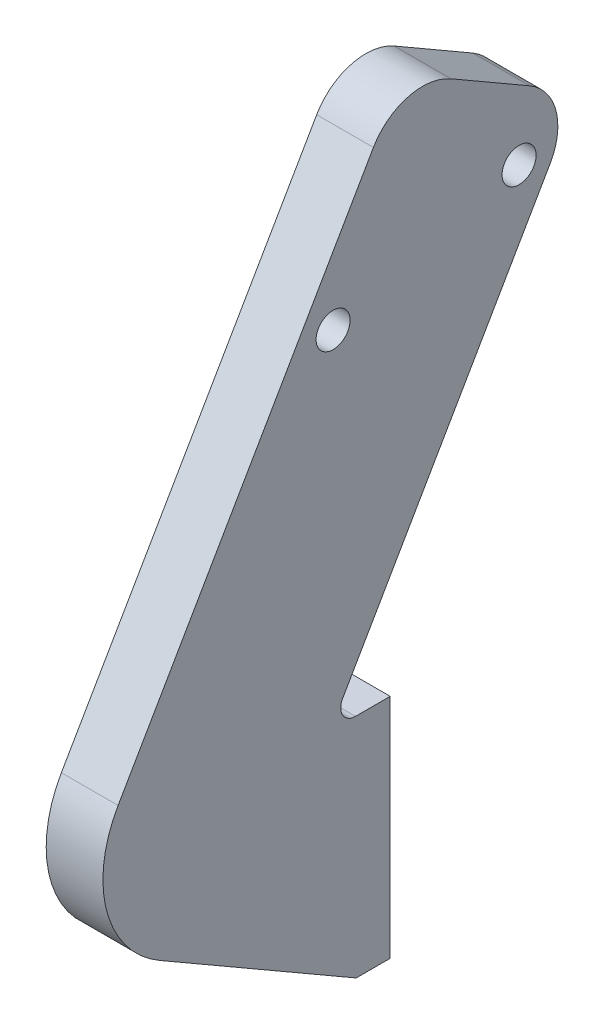
ISO-10303-21;
HEADER;
FILE_DESCRIPTION(('STEP AP214'),'2;1');
FILE_NAME('part.step','',(''),(''),'','','');
FILE_SCHEMA(('AUTOMOTIVE_DESIGN { 1 0 10303 214 1 1 1 1 }'));
ENDSEC;
DATA;
#1=APPLICATION_CONTEXT('core data for automotive mechanical design processes');
#2=APPLICATION_PROTOCOL_DEFINITION('international standard','automotive_design',2000,#1);
#3=PRODUCT_CONTEXT('',#1,'mechanical');
#4=PRODUCT('Part','Part','',(#3));
#5=PRODUCT_RELATED_PRODUCT_CATEGORY('part','',(#4));
#6=PRODUCT_DEFINITION_FORMATION('','',#4);
#7=PRODUCT_DEFINITION_CONTEXT('part definition',#1,'design');
#8=PRODUCT_DEFINITION('design','',#6,#7);
#9=PRODUCT_DEFINITION_SHAPE('','',#8);
#10=(LENGTH_UNIT() NAMED_UNIT(*) SI_UNIT(.MILLI.,.METRE.));
#11=(NAMED_UNIT(*) PLANE_ANGLE_UNIT() SI_UNIT($,.RADIAN.));
#12=(NAMED_UNIT(*) SI_UNIT($,.STERADIAN.) SOLID_ANGLE_UNIT());
#13=UNCERTAINTY_MEASURE_WITH_UNIT(LENGTH_MEASURE(1.E-05),#10,'distance_accuracy_value','');
#14=(GEOMETRIC_REPRESENTATION_CONTEXT(3) GLOBAL_UNCERTAINTY_ASSIGNED_CONTEXT((#13)) GLOBAL_UNIT_ASSIGNED_CONTEXT((#10,
#11,#12)) REPRESENTATION_CONTEXT('',''));
#15=CARTESIAN_POINT('',(0.,0.,0.));
#16=DIRECTION('',(0.,0.,1.));
#17=DIRECTION('',(1.,0.,0.));
#18=AXIS2_PLACEMENT_3D('',#15,#16,#17);
#19=CARTESIAN_POINT('',(0.,0.,3.));
#20=DIRECTION('',(0.,0.,-1.));
#21=DIRECTION('',(-1.,0.,0.));
#22=AXIS2_PLACEMENT_3D('',#19,#20,#21);
#23=PLANE('',#22);
#24=DIRECTION('',(1.,0.,0.));
#25=VECTOR('',#24,1.);
#26=CARTESIAN_POINT('',(0.,0.,3.));
#27=LINE('',#26,#25);
#28=CARTESIAN_POINT('',(0.,0.,3.));
#29=VERTEX_POINT('',#28);
#30=CARTESIAN_POINT('',(6.,0.,3.));
#31=VERTEX_POINT('',#30);
#32=EDGE_CURVE('E196',#29,#31,#27,.T.);
#33=ORIENTED_EDGE('',*,*,#32,.T.);
#34=DIRECTION('',(0.,-1.,0.));
#35=VECTOR('',#34,1.);
#36=CARTESIAN_POINT('',(6.,20.,3.));
#37=LINE('',#36,#35);
#38=CARTESIAN_POINT('',(6.,20.,3.));
#39=VERTEX_POINT('',#38);
#40=EDGE_CURVE('E170',#39,#31,#37,.T.);
#41=ORIENTED_EDGE('',*,*,#40,.F.);
#42=DIRECTION('',(-1.,0.,0.));
#43=VECTOR('',#42,1.);
#44=CARTESIAN_POINT('',(0.,20.,3.));
#45=LINE('',#44,#43);
#46=CARTESIAN_POINT('',(0.,20.,3.));
#47=VERTEX_POINT('',#46);
#48=EDGE_CURVE('E199',#39,#47,#45,.T.);
#49=ORIENTED_EDGE('',*,*,#48,.T.);
#50=DIRECTION('',(0.,-1.,0.));
#51=VECTOR('',#50,1.);
#52=CARTESIAN_POINT('',(0.,0.,3.));
#53=LINE('',#52,#51);
#54=EDGE_CURVE('E193',#47,#29,#53,.T.);
#55=ORIENTED_EDGE('',*,*,#54,.T.);
#56=EDGE_LOOP('',(#33,#41,#49,#55));
#57=FACE_BOUND('',#56,.T.);
#58=CARTESIAN_POINT('',(3.,16.25,3.));
#59=DIRECTION('',(0.,0.,1.));
#60=DIRECTION('',(1.,0.,0.));
#61=AXIS2_PLACEMENT_3D('',#58,#59,#60);
#62=CIRCLE('',#61,1.5);
#63=CARTESIAN_POINT('',(4.5,16.25,3.));
#64=VERTEX_POINT('',#63);
#65=EDGE_CURVE('E187',#64,#64,#62,.T.);
#66=ORIENTED_EDGE('',*,*,#65,.F.);
#67=EDGE_LOOP('',(#66));
#68=FACE_BOUND('',#67,.T.);
#69=CARTESIAN_POINT('',(3.00000000000013,3.75,3.));
#70=DIRECTION('',(0.,0.,1.));
#71=DIRECTION('',(1.,0.,0.));
#72=AXIS2_PLACEMENT_3D('',#69,#70,#71);
#73=CIRCLE('',#72,1.5);
#74=CARTESIAN_POINT('',(4.50000000000013,3.75,3.));
#75=VERTEX_POINT('',#74);
#76=EDGE_CURVE('E181',#75,#75,#73,.T.);
#77=ORIENTED_EDGE('',*,*,#76,.F.);
#78=EDGE_LOOP('',(#77));
#79=FACE_BOUND('',#78,.T.);
#80=ADVANCED_FACE('F37',(#57,#68,#79),#23,.F.);
#81=CARTESIAN_POINT('',(0.,0.,0.));
#82=DIRECTION('',(0.,0.,-1.));
#83=DIRECTION('',(-1.,0.,0.));
#84=AXIS2_PLACEMENT_3D('',#81,#82,#83);
#85=PLANE('',#84);
#86=DIRECTION('',(0.,1.,0.));
#87=VECTOR('',#86,1.);
#88=CARTESIAN_POINT('',(11.,0.,0.));
#89=LINE('',#88,#87);
#90=CARTESIAN_POINT('',(11.,0.,0.));
#91=VERTEX_POINT('',#90);
#92=CARTESIAN_POINT('',(11.,20.,0.));
#93=VERTEX_POINT('',#92);
#94=EDGE_CURVE('E137',#91,#93,#89,.T.);
#95=ORIENTED_EDGE('',*,*,#94,.F.);
#96=DIRECTION('',(1.,0.,0.));
#97=VECTOR('',#96,1.);
#98=CARTESIAN_POINT('',(0.,0.,0.));
#99=LINE('',#98,#97);
#100=CARTESIAN_POINT('',(0.,0.,0.));
#101=VERTEX_POINT('',#100);
#102=EDGE_CURVE('E132',#101,#91,#99,.T.);
#103=ORIENTED_EDGE('',*,*,#102,.F.);
#104=DIRECTION('',(0.,-1.,0.));
#105=VECTOR('',#104,1.);
#106=CARTESIAN_POINT('',(0.,0.,0.));
#107=LINE('',#106,#105);
#108=CARTESIAN_POINT('',(0.,20.,0.));
#109=VERTEX_POINT('',#108);
#110=EDGE_CURVE('E190',#109,#101,#107,.T.);
#111=ORIENTED_EDGE('',*,*,#110,.F.);
#112=DIRECTION('',(-1.,0.,0.));
#113=VECTOR('',#112,1.);
#114=CARTESIAN_POINT('',(0.,20.,0.));
#115=LINE('',#114,#113);
#116=EDGE_CURVE('E197',#93,#109,#115,.T.);
#117=ORIENTED_EDGE('',*,*,#116,.F.);
#118=EDGE_LOOP('',(#95,#103,#111,#117));
#119=FACE_BOUND('',#118,.T.);
#120=CARTESIAN_POINT('',(3.,16.25,0.));
#121=DIRECTION('',(0.,0.,1.));
#122=DIRECTION('',(1.,0.,0.));
#123=AXIS2_PLACEMENT_3D('',#120,#121,#122);
#124=CIRCLE('',#123,1.5);
#125=CARTESIAN_POINT('',(4.5,16.25,0.));
#126=VERTEX_POINT('',#125);
#127=EDGE_CURVE('E184',#126,#126,#124,.T.);
#128=ORIENTED_EDGE('',*,*,#127,.T.);
#129=EDGE_LOOP('',(#128));
#130=FACE_BOUND('',#129,.T.);
#131=CARTESIAN_POINT('',(3.00000000000013,3.75,0.));
#132=DIRECTION('',(0.,0.,1.));
#133=DIRECTION('',(1.,0.,0.));
#134=AXIS2_PLACEMENT_3D('',#131,#132,#133);
#135=CIRCLE('',#134,1.5);
#136=CARTESIAN_POINT('',(4.50000000000013,3.75,0.));
#137=VERTEX_POINT('',#136);
#138=EDGE_CURVE('E148',#137,#137,#135,.T.);
#139=ORIENTED_EDGE('',*,*,#138,.T.);
#140=EDGE_LOOP('',(#139));
#141=FACE_BOUND('',#140,.T.);
#142=ADVANCED_FACE('F255',(#119,#130,#141),#85,.T.);
#143=CARTESIAN_POINT('',(0.,0.,3.));
#144=DIRECTION('',(1.,0.,0.));
#145=DIRECTION('',(0.,0.,-1.));
#146=AXIS2_PLACEMENT_3D('',#143,#144,#145);
#147=PLANE('',#146);
#148=ORIENTED_EDGE('',*,*,#110,.T.);
#149=DIRECTION('',(0.,0.,-1.));
#150=VECTOR('',#149,1.);
#151=CARTESIAN_POINT('',(0.,0.,3.));
#152=LINE('',#151,#150);
#153=EDGE_CURVE('E208',#29,#101,#152,.T.);
#154=ORIENTED_EDGE('',*,*,#153,.F.);
#155=ORIENTED_EDGE('',*,*,#54,.F.);
#156=DIRECTION('',(0.,0.,-1.));
#157=VECTOR('',#156,1.);
#158=CARTESIAN_POINT('',(0.,20.,3.));
#159=LINE('',#158,#157);
#160=EDGE_CURVE('E201',#47,#109,#159,.T.);
#161=ORIENTED_EDGE('',*,*,#160,.T.);
#162=EDGE_LOOP('',(#148,#154,#155,#161));
#163=FACE_BOUND('',#162,.T.);
#164=ADVANCED_FACE('F252',(#163),#147,.F.);
#165=CARTESIAN_POINT('',(0.,0.,3.));
#166=DIRECTION('',(0.,1.,0.));
#167=DIRECTION('',(0.,0.,1.));
#168=AXIS2_PLACEMENT_3D('',#165,#166,#167);
#169=PLANE('',#168);
#170=ORIENTED_EDGE('',*,*,#102,.T.);
#171=DIRECTION('',(0.,0.,1.));
#172=VECTOR('',#171,1.);
#173=CARTESIAN_POINT('',(11.,0.,-7.));
#174=LINE('',#173,#172);
#175=CARTESIAN_POINT('',(11.,0.,3.));
#176=VERTEX_POINT('',#175);
#177=EDGE_CURVE('E126',#91,#176,#174,.T.);
#178=ORIENTED_EDGE('',*,*,#177,.T.);
#179=DIRECTION('',(-1.,0.,0.));
#180=VECTOR('',#179,1.);
#181=CARTESIAN_POINT('',(11.,0.,3.));
#182=LINE('',#181,#180);
#183=EDGE_CURVE('E129',#176,#31,#182,.T.);
#184=ORIENTED_EDGE('',*,*,#183,.T.);
#185=ORIENTED_EDGE('',*,*,#32,.F.);
#186=ORIENTED_EDGE('',*,*,#153,.T.);
#187=EDGE_LOOP('',(#170,#178,#184,#185,#186));
#188=FACE_BOUND('',#187,.T.);
#189=ADVANCED_FACE('F128',(#188),#169,.F.);
#190=CARTESIAN_POINT('',(0.,20.,3.));
#191=DIRECTION('',(0.,-1.,0.));
#192=DIRECTION('',(0.,0.,-1.));
#193=AXIS2_PLACEMENT_3D('',#190,#191,#192);
#194=PLANE('',#193);
#195=DIRECTION('',(0.,0.,-1.));
#196=VECTOR('',#195,1.);
#197=CARTESIAN_POINT('',(11.,20.,3.));
#198=LINE('',#197,#196);
#199=CARTESIAN_POINT('',(11.,20.,3.05773502691893));
#200=VERTEX_POINT('',#199);
#201=EDGE_CURVE('E149',#200,#93,#198,.T.);
#202=ORIENTED_EDGE('',*,*,#201,.T.);
#203=ORIENTED_EDGE('',*,*,#116,.T.);
#204=ORIENTED_EDGE('',*,*,#160,.F.);
#205=ORIENTED_EDGE('',*,*,#48,.F.);
#206=DIRECTION('',(0.,0.,-1.));
#207=VECTOR('',#206,1.);
#208=CARTESIAN_POINT('',(6.,20.,3.));
#209=LINE('',#208,#207);
#210=CARTESIAN_POINT('',(6.,20.,3.05773502691893));
#211=VERTEX_POINT('',#210);
#212=EDGE_CURVE('E154',#211,#39,#209,.T.);
#213=ORIENTED_EDGE('',*,*,#212,.F.);
#214=DIRECTION('',(-1.,0.,0.));
#215=VECTOR('',#214,1.);
#216=CARTESIAN_POINT('',(0.,20.,3.05773502691893));
#217=LINE('',#216,#215);
#218=EDGE_CURVE('E232',#211,#200,#217,.F.);
#219=ORIENTED_EDGE('',*,*,#218,.T.);
#220=EDGE_LOOP('',(#202,#203,#204,#205,#213,#219));
#221=FACE_BOUND('',#220,.T.);
#222=ADVANCED_FACE('F299',(#221),#194,.F.);
#223=CARTESIAN_POINT('',(3.,16.25,3.));
#224=DIRECTION('',(0.,0.,-1.));
#225=DIRECTION('',(-1.,0.,0.));
#226=AXIS2_PLACEMENT_3D('',#223,#224,#225);
#227=CYLINDRICAL_SURFACE('',#226,1.5);
#228=ORIENTED_EDGE('',*,*,#65,.T.);
#229=EDGE_LOOP('',(#228));
#230=FACE_BOUND('',#229,.T.);
#231=ORIENTED_EDGE('',*,*,#127,.F.);
#232=EDGE_LOOP('',(#231));
#233=FACE_BOUND('',#232,.T.);
#234=ADVANCED_FACE('F296',(#230,#233),#227,.F.);
#235=CARTESIAN_POINT('',(3.00000000000013,3.75,3.));
#236=DIRECTION('',(0.,0.,-1.));
#237=DIRECTION('',(-1.,0.,0.));
#238=AXIS2_PLACEMENT_3D('',#235,#236,#237);
#239=CYLINDRICAL_SURFACE('',#238,1.5);
#240=ORIENTED_EDGE('',*,*,#76,.T.);
#241=EDGE_LOOP('',(#240));
#242=FACE_BOUND('',#241,.T.);
#243=ORIENTED_EDGE('',*,*,#138,.F.);
#244=EDGE_LOOP('',(#243));
#245=FACE_BOUND('',#244,.T.);
#246=ADVANCED_FACE('F345',(#242,#245),#239,.F.);
#247=CARTESIAN_POINT('',(11.,20.,5.30940107675848));
#248=DIRECTION('',(0.,-0.500000000000001,-0.866025403784438));
#249=DIRECTION('',(0.,0.866025403784438,-0.500000000000001));
#250=AXIS2_PLACEMENT_3D('',#247,#248,#249);
#251=PLANE('',#250);
#252=DIRECTION('',(0.,-0.866025403784438,0.500000000000001));
#253=VECTOR('',#252,1.);
#254=CARTESIAN_POINT('',(11.,20.,5.30940107675848));
#255=LINE('',#254,#253);
#256=CARTESIAN_POINT('',(11.,53.6313972081441,-14.1076951545868));
#257=VERTEX_POINT('',#256);
#258=CARTESIAN_POINT('',(11.,21.95,4.1835680518387));
#259=VERTEX_POINT('',#258);
#260=EDGE_CURVE('E166',#257,#259,#255,.T.);
#261=ORIENTED_EDGE('',*,*,#260,.T.);
#262=DIRECTION('',(-1.,0.,0.));
#263=VECTOR('',#262,1.);
#264=CARTESIAN_POINT('',(11.,21.95,4.1835680518387));
#265=LINE('',#264,#263);
#266=CARTESIAN_POINT('',(6.,21.95,4.1835680518387));
#267=VERTEX_POINT('',#266);
#268=EDGE_CURVE('E229',#259,#267,#265,.T.);
#269=ORIENTED_EDGE('',*,*,#268,.T.);
#270=DIRECTION('',(0.,-0.866025403784438,0.500000000000001));
#271=VECTOR('',#270,1.);
#272=CARTESIAN_POINT('',(6.,20.,5.30940107675848));
#273=LINE('',#272,#271);
#274=CARTESIAN_POINT('',(6.,53.6313972081441,-14.1076951545868));
#275=VERTEX_POINT('',#274);
#276=EDGE_CURVE('E158',#275,#267,#273,.T.);
#277=ORIENTED_EDGE('',*,*,#276,.F.);
#278=DIRECTION('',(-1.,0.,0.));
#279=VECTOR('',#278,1.);
#280=CARTESIAN_POINT('',(11.,53.6313972081441,-14.1076951545868));
#281=LINE('',#280,#279);
#282=EDGE_CURVE('E227',#275,#257,#281,.F.);
#283=ORIENTED_EDGE('',*,*,#282,.T.);
#284=EDGE_LOOP('',(#261,#269,#277,#283));
#285=FACE_BOUND('',#284,.T.);
#286=ADVANCED_FACE('F326',(#285),#251,.T.);
#287=CARTESIAN_POINT('',(11.,57.9615242270663,-16.6076951545868));
#288=DIRECTION('',(0.,0.866025403784438,-0.500000000000002));
#289=DIRECTION('',(0.,0.500000000000002,0.866025403784438));
#290=AXIS2_PLACEMENT_3D('',#287,#288,#289);
#291=PLANE('',#290);
#292=DIRECTION('',(0.,-0.500000000000002,-0.866025403784438));
#293=VECTOR('',#292,1.);
#294=CARTESIAN_POINT('',(6.,57.9615242270663,-16.6076951545868));
#295=LINE('',#294,#293);
#296=CARTESIAN_POINT('',(6.,64.4615242270663,-5.34936490538914));
#297=VERTEX_POINT('',#296);
#298=CARTESIAN_POINT('',(6.,60.4615242270663,-12.2775681356646));
#299=VERTEX_POINT('',#298);
#300=EDGE_CURVE('E176',#297,#299,#295,.T.);
#301=ORIENTED_EDGE('',*,*,#300,.F.);
#302=DIRECTION('',(-1.,0.,0.));
#303=VECTOR('',#302,1.);
#304=CARTESIAN_POINT('',(11.,64.4615242270663,-5.34936490538914));
#305=LINE('',#304,#303);
#306=CARTESIAN_POINT('',(11.,64.4615242270663,-5.34936490538914));
#307=VERTEX_POINT('',#306);
#308=EDGE_CURVE('E220',#297,#307,#305,.F.);
#309=ORIENTED_EDGE('',*,*,#308,.T.);
#310=DIRECTION('',(0.,-0.500000000000002,-0.866025403784438));
#311=VECTOR('',#310,1.);
#312=CARTESIAN_POINT('',(11.,57.9615242270663,-16.6076951545868));
#313=LINE('',#312,#311);
#314=CARTESIAN_POINT('',(11.,60.4615242270663,-12.2775681356646));
#315=VERTEX_POINT('',#314);
#316=EDGE_CURVE('E156',#307,#315,#313,.T.);
#317=ORIENTED_EDGE('',*,*,#316,.T.);
#318=DIRECTION('',(-1.,0.,0.));
#319=VECTOR('',#318,1.);
#320=CARTESIAN_POINT('',(11.,60.4615242270663,-12.2775681356646));
#321=LINE('',#320,#319);
#322=EDGE_CURVE('E217',#315,#299,#321,.T.);
#323=ORIENTED_EDGE('',*,*,#322,.T.);
#324=EDGE_LOOP('',(#301,#309,#317,#323));
#325=FACE_BOUND('',#324,.T.);
#326=ADVANCED_FACE('F334',(#325),#291,.T.);
#327=CARTESIAN_POINT('',(11.,66.9615242270663,-1.01923788646695));
#328=DIRECTION('',(0.,0.500000000000001,0.866025403784438));
#329=DIRECTION('',(0.,-0.866025403784438,0.500000000000001));
#330=AXIS2_PLACEMENT_3D('',#327,#328,#329);
#331=PLANE('',#330);
#332=DIRECTION('',(0.,0.866025403784438,-0.500000000000001));
#333=VECTOR('',#332,1.);
#334=CARTESIAN_POINT('',(6.,66.9615242270663,-1.01923788646695));
#335=LINE('',#334,#333);
#336=CARTESIAN_POINT('',(6.,23.6602540378444,23.9807621135331));
#337=VERTEX_POINT('',#336);
#338=CARTESIAN_POINT('',(6.,62.6313972081441,1.48076211353305));
#339=VERTEX_POINT('',#338);
#340=EDGE_CURVE('E174',#337,#339,#335,.T.);
#341=ORIENTED_EDGE('',*,*,#340,.F.);
#342=DIRECTION('',(-1.,0.,0.));
#343=VECTOR('',#342,1.);
#344=CARTESIAN_POINT('',(11.,23.6602540378444,23.9807621135331));
#345=LINE('',#344,#343);
#346=CARTESIAN_POINT('',(11.,23.6602540378444,23.9807621135331));
#347=VERTEX_POINT('',#346);
#348=EDGE_CURVE('E45',#337,#347,#345,.F.);
#349=ORIENTED_EDGE('',*,*,#348,.T.);
#350=DIRECTION('',(0.,0.866025403784438,-0.500000000000001));
#351=VECTOR('',#350,1.);
#352=CARTESIAN_POINT('',(11.,66.9615242270663,-1.01923788646695));
#353=LINE('',#352,#351);
#354=CARTESIAN_POINT('',(11.,62.6313972081441,1.48076211353305));
#355=VERTEX_POINT('',#354);
#356=EDGE_CURVE('E153',#347,#355,#353,.T.);
#357=ORIENTED_EDGE('',*,*,#356,.T.);
#358=DIRECTION('',(-1.,0.,0.));
#359=VECTOR('',#358,1.);
#360=CARTESIAN_POINT('',(11.,62.6313972081441,1.48076211353305));
#361=LINE('',#360,#359);
#362=EDGE_CURVE('E210',#355,#339,#361,.T.);
#363=ORIENTED_EDGE('',*,*,#362,.T.);
#364=EDGE_LOOP('',(#341,#349,#357,#363));
#365=FACE_BOUND('',#364,.T.);
#366=ADVANCED_FACE('F286',(#365),#331,.T.);
#367=CARTESIAN_POINT('',(11.,15.,28.9807621135331));
#368=DIRECTION('',(0.,-0.866025403784438,0.500000000000001));
#369=DIRECTION('',(0.,-0.500000000000001,-0.866025403784438));
#370=AXIS2_PLACEMENT_3D('',#367,#368,#369);
#371=PLANE('',#370);
#372=DIRECTION('',(0.,0.500000000000001,0.866025403784438));
#373=VECTOR('',#372,1.);
#374=CARTESIAN_POINT('',(11.,15.,28.9807621135331));
#375=LINE('',#374,#373);
#376=CARTESIAN_POINT('',(11.,10.,20.3205080756888));
#377=VERTEX_POINT('',#376);
#378=EDGE_CURVE('E144',#176,#377,#375,.T.);
#379=ORIENTED_EDGE('',*,*,#378,.T.);
#380=DIRECTION('',(-1.,0.,0.));
#381=VECTOR('',#380,1.);
#382=CARTESIAN_POINT('',(11.,10.,20.3205080756888));
#383=LINE('',#382,#381);
#384=CARTESIAN_POINT('',(6.,10.,20.3205080756888));
#385=VERTEX_POINT('',#384);
#386=EDGE_CURVE('E238',#377,#385,#383,.T.);
#387=ORIENTED_EDGE('',*,*,#386,.T.);
#388=DIRECTION('',(0.,0.500000000000001,0.866025403784438));
#389=VECTOR('',#388,1.);
#390=CARTESIAN_POINT('',(6.,15.,28.9807621135331));
#391=LINE('',#390,#389);
#392=EDGE_CURVE('E146',#31,#385,#391,.T.);
#393=ORIENTED_EDGE('',*,*,#392,.F.);
#394=ORIENTED_EDGE('',*,*,#183,.F.);
#395=EDGE_LOOP('',(#379,#387,#393,#394));
#396=FACE_BOUND('',#395,.T.);
#397=ADVANCED_FACE('F142',(#396),#371,.T.);
#398=CARTESIAN_POINT('',(11.,0.,0.));
#399=DIRECTION('',(-1.,0.,0.));
#400=DIRECTION('',(0.,0.,1.));
#401=AXIS2_PLACEMENT_3D('',#398,#399,#400);
#402=PLANE('',#401);
#403=CARTESIAN_POINT('',(11.,50.4792847415955,5.03268590217988));
#404=DIRECTION('',(1.,0.,0.));
#405=DIRECTION('',(0.,0.,-1.));
#406=AXIS2_PLACEMENT_3D('',#403,#404,#405);
#407=CIRCLE('',#406,1.5);
#408=CARTESIAN_POINT('',(11.,50.4792847415955,3.53268590217988));
#409=VERTEX_POINT('',#408);
#410=EDGE_CURVE('E264',#409,#409,#407,.T.);
#411=ORIENTED_EDGE('',*,*,#410,.F.);
#412=EDGE_LOOP('',(#411));
#413=FACE_BOUND('',#412,.T.);
#414=CARTESIAN_POINT('',(11.,54.8715895870088,-11.3596189432334));
#415=DIRECTION('',(1.,0.,0.));
#416=DIRECTION('',(0.,0.,-1.));
#417=AXIS2_PLACEMENT_3D('',#414,#415,#416);
#418=CIRCLE('',#417,1.5);
#419=CARTESIAN_POINT('',(11.,54.8715895870088,-12.8596189432335));
#420=VERTEX_POINT('',#419);
#421=EDGE_CURVE('E161',#420,#420,#418,.T.);
#422=ORIENTED_EDGE('',*,*,#421,.F.);
#423=EDGE_LOOP('',(#422));
#424=FACE_BOUND('',#423,.T.);
#425=ORIENTED_EDGE('',*,*,#356,.F.);
#426=CARTESIAN_POINT('',(11.,18.6602540378444,15.3205080756887));
#427=DIRECTION('',(-1.,0.,0.));
#428=DIRECTION('',(0.,0.,1.));
#429=AXIS2_PLACEMENT_3D('',#426,#427,#428);
#430=CIRCLE('',#429,10.);
#431=EDGE_CURVE('E11',#347,#377,#430,.F.);
#432=ORIENTED_EDGE('',*,*,#431,.T.);
#433=ORIENTED_EDGE('',*,*,#378,.F.);
#434=ORIENTED_EDGE('',*,*,#177,.F.);
#435=ORIENTED_EDGE('',*,*,#94,.T.);
#436=ORIENTED_EDGE('',*,*,#201,.F.);
#437=CARTESIAN_POINT('',(11.,21.3,3.05773502691893));
#438=DIRECTION('',(-1.,0.,0.));
#439=DIRECTION('',(0.,0.,1.));
#440=AXIS2_PLACEMENT_3D('',#437,#438,#439);
#441=CIRCLE('',#440,1.3);
#442=EDGE_CURVE('E236',#200,#259,#441,.T.);
#443=ORIENTED_EDGE('',*,*,#442,.T.);
#444=ORIENTED_EDGE('',*,*,#260,.F.);
#445=CARTESIAN_POINT('',(11.,56.1313972081441,-9.77756813566463));
#446=DIRECTION('',(-1.,0.,0.));
#447=DIRECTION('',(0.,0.,1.));
#448=AXIS2_PLACEMENT_3D('',#445,#446,#447);
#449=CIRCLE('',#448,5.);
#450=EDGE_CURVE('E222',#257,#315,#449,.F.);
#451=ORIENTED_EDGE('',*,*,#450,.T.);
#452=ORIENTED_EDGE('',*,*,#316,.F.);
#453=CARTESIAN_POINT('',(11.,60.1313972081441,-2.84936490538913));
#454=DIRECTION('',(-1.,0.,0.));
#455=DIRECTION('',(0.,0.,1.));
#456=AXIS2_PLACEMENT_3D('',#453,#454,#455);
#457=CIRCLE('',#456,5.);
#458=EDGE_CURVE('E224',#307,#355,#457,.F.);
#459=ORIENTED_EDGE('',*,*,#458,.T.);
#460=EDGE_LOOP('',(#425,#432,#433,#434,#435,#436,#443,#444,#451,#452,#459));
#461=FACE_BOUND('',#460,.T.);
#462=ADVANCED_FACE('F151',(#413,#424,#461),#402,.F.);
#463=CARTESIAN_POINT('',(6.,0.,0.));
#464=DIRECTION('',(-1.,0.,0.));
#465=DIRECTION('',(0.,0.,1.));
#466=AXIS2_PLACEMENT_3D('',#463,#464,#465);
#467=PLANE('',#466);
#468=CARTESIAN_POINT('',(6.,50.4792847415955,5.03268590217988));
#469=DIRECTION('',(1.,0.,0.));
#470=DIRECTION('',(0.,0.,-1.));
#471=AXIS2_PLACEMENT_3D('',#468,#469,#470);
#472=CIRCLE('',#471,1.5);
#473=CARTESIAN_POINT('',(6.,50.4792847415955,3.53268590217988));
#474=VERTEX_POINT('',#473);
#475=EDGE_CURVE('E172',#474,#474,#472,.T.);
#476=ORIENTED_EDGE('',*,*,#475,.T.);
#477=EDGE_LOOP('',(#476));
#478=FACE_BOUND('',#477,.T.);
#479=CARTESIAN_POINT('',(6.,54.8715895870088,-11.3596189432334));
#480=DIRECTION('',(1.,0.,0.));
#481=DIRECTION('',(0.,0.,-1.));
#482=AXIS2_PLACEMENT_3D('',#479,#480,#481);
#483=CIRCLE('',#482,1.5);
#484=CARTESIAN_POINT('',(6.,54.8715895870088,-12.8596189432335));
#485=VERTEX_POINT('',#484);
#486=EDGE_CURVE('E260',#485,#485,#483,.T.);
#487=ORIENTED_EDGE('',*,*,#486,.T.);
#488=EDGE_LOOP('',(#487));
#489=FACE_BOUND('',#488,.T.);
#490=ORIENTED_EDGE('',*,*,#392,.T.);
#491=CARTESIAN_POINT('',(6.,18.6602540378444,15.3205080756887));
#492=DIRECTION('',(-1.,0.,0.));
#493=DIRECTION('',(0.,0.,1.));
#494=AXIS2_PLACEMENT_3D('',#491,#492,#493);
#495=CIRCLE('',#494,10.);
#496=EDGE_CURVE('E59',#385,#337,#495,.T.);
#497=ORIENTED_EDGE('',*,*,#496,.T.);
#498=ORIENTED_EDGE('',*,*,#340,.T.);
#499=CARTESIAN_POINT('',(6.,60.1313972081441,-2.84936490538913));
#500=DIRECTION('',(-1.,0.,0.));
#501=DIRECTION('',(0.,0.,1.));
#502=AXIS2_PLACEMENT_3D('',#499,#500,#501);
#503=CIRCLE('',#502,5.);
#504=EDGE_CURVE('E215',#339,#297,#503,.T.);
#505=ORIENTED_EDGE('',*,*,#504,.T.);
#506=ORIENTED_EDGE('',*,*,#300,.T.);
#507=CARTESIAN_POINT('',(6.,56.1313972081441,-9.77756813566463));
#508=DIRECTION('',(-1.,0.,0.));
#509=DIRECTION('',(0.,0.,1.));
#510=AXIS2_PLACEMENT_3D('',#507,#508,#509);
#511=CIRCLE('',#510,5.);
#512=EDGE_CURVE('E213',#299,#275,#511,.T.);
#513=ORIENTED_EDGE('',*,*,#512,.T.);
#514=ORIENTED_EDGE('',*,*,#276,.T.);
#515=CARTESIAN_POINT('',(6.,21.3,3.05773502691893));
#516=DIRECTION('',(-1.,0.,0.));
#517=DIRECTION('',(0.,0.,1.));
#518=AXIS2_PLACEMENT_3D('',#515,#516,#517);
#519=CIRCLE('',#518,1.3);
#520=EDGE_CURVE('E234',#267,#211,#519,.F.);
#521=ORIENTED_EDGE('',*,*,#520,.T.);
#522=ORIENTED_EDGE('',*,*,#212,.T.);
#523=ORIENTED_EDGE('',*,*,#40,.T.);
#524=EDGE_LOOP('',(#490,#497,#498,#505,#506,#513,#514,#521,#522,#523));
#525=FACE_BOUND('',#524,.T.);
#526=ADVANCED_FACE('F241',(#478,#489,#525),#467,.T.);
#527=CARTESIAN_POINT('',(6.,54.8715895870088,-11.3596189432334));
#528=DIRECTION('',(1.,0.,0.));
#529=DIRECTION('',(0.,0.,-1.));
#530=AXIS2_PLACEMENT_3D('',#527,#528,#529);
#531=CYLINDRICAL_SURFACE('',#530,1.5);
#532=ORIENTED_EDGE('',*,*,#486,.F.);
#533=EDGE_LOOP('',(#532));
#534=FACE_BOUND('',#533,.T.);
#535=ORIENTED_EDGE('',*,*,#421,.T.);
#536=EDGE_LOOP('',(#535));
#537=FACE_BOUND('',#536,.T.);
#538=ADVANCED_FACE('F270',(#534,#537),#531,.F.);
#539=CARTESIAN_POINT('',(6.,50.4792847415955,5.03268590217988));
#540=DIRECTION('',(1.,0.,0.));
#541=DIRECTION('',(0.,0.,-1.));
#542=AXIS2_PLACEMENT_3D('',#539,#540,#541);
#543=CYLINDRICAL_SURFACE('',#542,1.5);
#544=ORIENTED_EDGE('',*,*,#475,.F.);
#545=EDGE_LOOP('',(#544));
#546=FACE_BOUND('',#545,.T.);
#547=ORIENTED_EDGE('',*,*,#410,.T.);
#548=EDGE_LOOP('',(#547));
#549=FACE_BOUND('',#548,.T.);
#550=ADVANCED_FACE('F273',(#546,#549),#543,.F.);
#551=CARTESIAN_POINT('',(11.,60.1313972081441,-2.84936490538913));
#552=DIRECTION('',(-1.,0.,0.));
#553=DIRECTION('',(0.,0.,1.));
#554=AXIS2_PLACEMENT_3D('',#551,#552,#553);
#555=CYLINDRICAL_SURFACE('',#554,5.);
#556=ORIENTED_EDGE('',*,*,#458,.F.);
#557=ORIENTED_EDGE('',*,*,#308,.F.);
#558=ORIENTED_EDGE('',*,*,#504,.F.);
#559=ORIENTED_EDGE('',*,*,#362,.F.);
#560=EDGE_LOOP('',(#556,#557,#558,#559));
#561=FACE_BOUND('',#560,.T.);
#562=ADVANCED_FACE('F307',(#561),#555,.T.);
#563=CARTESIAN_POINT('',(11.,56.1313972081441,-9.77756813566463));
#564=DIRECTION('',(-1.,0.,0.));
#565=DIRECTION('',(0.,0.,1.));
#566=AXIS2_PLACEMENT_3D('',#563,#564,#565);
#567=CYLINDRICAL_SURFACE('',#566,5.);
#568=ORIENTED_EDGE('',*,*,#450,.F.);
#569=ORIENTED_EDGE('',*,*,#282,.F.);
#570=ORIENTED_EDGE('',*,*,#512,.F.);
#571=ORIENTED_EDGE('',*,*,#322,.F.);
#572=EDGE_LOOP('',(#568,#569,#570,#571));
#573=FACE_BOUND('',#572,.T.);
#574=ADVANCED_FACE('F310',(#573),#567,.T.);
#575=CARTESIAN_POINT('',(11.,21.3,3.05773502691893));
#576=DIRECTION('',(-1.,0.,0.));
#577=DIRECTION('',(0.,0.,1.));
#578=AXIS2_PLACEMENT_3D('',#575,#576,#577);
#579=CYLINDRICAL_SURFACE('',#578,1.3);
#580=ORIENTED_EDGE('',*,*,#442,.F.);
#581=ORIENTED_EDGE('',*,*,#218,.F.);
#582=ORIENTED_EDGE('',*,*,#520,.F.);
#583=ORIENTED_EDGE('',*,*,#268,.F.);
#584=EDGE_LOOP('',(#580,#581,#582,#583));
#585=FACE_BOUND('',#584,.T.);
#586=ADVANCED_FACE('F313',(#585),#579,.F.);
#587=CARTESIAN_POINT('',(11.,18.6602540378444,15.3205080756887));
#588=DIRECTION('',(-1.,0.,0.));
#589=DIRECTION('',(0.,0.,1.));
#590=AXIS2_PLACEMENT_3D('',#587,#588,#589);
#591=CYLINDRICAL_SURFACE('',#590,10.);
#592=ORIENTED_EDGE('',*,*,#431,.F.);
#593=ORIENTED_EDGE('',*,*,#348,.F.);
#594=ORIENTED_EDGE('',*,*,#496,.F.);
#595=ORIENTED_EDGE('',*,*,#386,.F.);
#596=EDGE_LOOP('',(#592,#593,#594,#595));
#597=FACE_BOUND('',#596,.T.);
#598=ADVANCED_FACE('F39',(#597),#591,.T.);
#599=CLOSED_SHELL('',(#80,#142,#164,#189,#222,#234,#246,#286,#326,#366,#397,#462,#526,#538,#550,
#562,#574,#586,#598));
#600=MANIFOLD_SOLID_BREP('B2',#599);
#601=ADVANCED_BREP_SHAPE_REPRESENTATION('',(#18,#600),#14);
#602=SHAPE_DEFINITION_REPRESENTATION(#9,#601);
ENDSEC;
END-ISO-10303-21;
